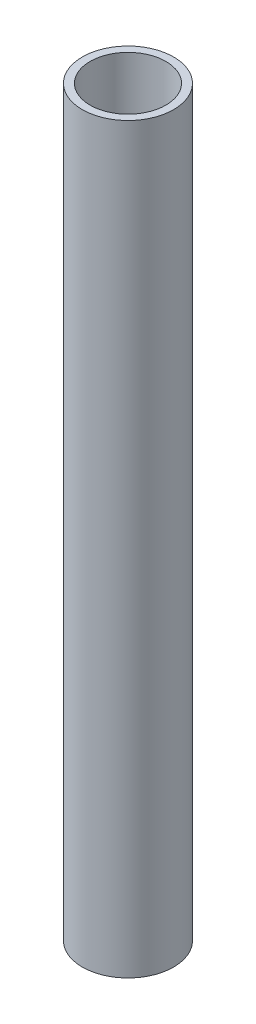
ISO-10303-21;
HEADER;
FILE_DESCRIPTION(('STEP AP214'),'2;1');
FILE_NAME('part.step','',(''),(''),'','','');
FILE_SCHEMA(('AUTOMOTIVE_DESIGN { 1 0 10303 214 1 1 1 1 }'));
ENDSEC;
DATA;
#1=APPLICATION_CONTEXT('core data for automotive mechanical design processes');
#2=APPLICATION_PROTOCOL_DEFINITION('international standard','automotive_design',2000,#1);
#3=PRODUCT_CONTEXT('',#1,'mechanical');
#4=PRODUCT('Part','Part','',(#3));
#5=PRODUCT_RELATED_PRODUCT_CATEGORY('part','',(#4));
#6=PRODUCT_DEFINITION_FORMATION('','',#4);
#7=PRODUCT_DEFINITION_CONTEXT('part definition',#1,'design');
#8=PRODUCT_DEFINITION('design','',#6,#7);
#9=PRODUCT_DEFINITION_SHAPE('','',#8);
#10=(LENGTH_UNIT() NAMED_UNIT(*) SI_UNIT(.MILLI.,.METRE.));
#11=(NAMED_UNIT(*) PLANE_ANGLE_UNIT() SI_UNIT($,.RADIAN.));
#12=(NAMED_UNIT(*) SI_UNIT($,.STERADIAN.) SOLID_ANGLE_UNIT());
#13=UNCERTAINTY_MEASURE_WITH_UNIT(LENGTH_MEASURE(1.E-05),#10,'distance_accuracy_value','');
#14=(GEOMETRIC_REPRESENTATION_CONTEXT(3) GLOBAL_UNCERTAINTY_ASSIGNED_CONTEXT((#13)) GLOBAL_UNIT_ASSIGNED_CONTEXT((#10,
#11,#12)) REPRESENTATION_CONTEXT('',''));
#15=CARTESIAN_POINT('',(0.,0.,0.));
#16=DIRECTION('',(0.,0.,1.));
#17=DIRECTION('',(1.,0.,0.));
#18=AXIS2_PLACEMENT_3D('',#15,#16,#17);
#19=CARTESIAN_POINT('',(0.,342.9,0.));
#20=DIRECTION('',(0.,1.,0.));
#21=DIRECTION('',(0.,0.,1.));
#22=AXIS2_PLACEMENT_3D('',#19,#20,#21);
#23=PLANE('',#22);
#24=CARTESIAN_POINT('',(0.,342.9,0.));
#25=DIRECTION('',(0.,1.,0.));
#26=DIRECTION('',(0.,0.,1.));
#27=AXIS2_PLACEMENT_3D('',#24,#25,#26);
#28=CIRCLE('',#27,21.082);
#29=CARTESIAN_POINT('',(0.,342.9,21.082));
#30=VERTEX_POINT('',#29);
#31=EDGE_CURVE('E10',#30,#30,#28,.T.);
#32=ORIENTED_EDGE('',*,*,#31,.T.);
#33=EDGE_LOOP('',(#32));
#34=FACE_BOUND('',#33,.T.);
#35=CARTESIAN_POINT('',(0.,342.9,0.));
#36=DIRECTION('',(0.,1.,0.));
#37=DIRECTION('',(0.,0.,1.));
#38=AXIS2_PLACEMENT_3D('',#35,#36,#37);
#39=CIRCLE('',#38,17.5006);
#40=CARTESIAN_POINT('',(0.,342.9,17.5006));
#41=VERTEX_POINT('',#40);
#42=EDGE_CURVE('E46',#41,#41,#39,.T.);
#43=ORIENTED_EDGE('',*,*,#42,.F.);
#44=EDGE_LOOP('',(#43));
#45=FACE_BOUND('',#44,.T.);
#46=ADVANCED_FACE('F35',(#34,#45),#23,.T.);
#47=CARTESIAN_POINT('',(0.,0.,0.));
#48=DIRECTION('',(0.,1.,0.));
#49=DIRECTION('',(0.,0.,1.));
#50=AXIS2_PLACEMENT_3D('',#47,#48,#49);
#51=PLANE('',#50);
#52=CARTESIAN_POINT('',(0.,0.,0.));
#53=DIRECTION('',(0.,1.,0.));
#54=DIRECTION('',(0.,0.,1.));
#55=AXIS2_PLACEMENT_3D('',#52,#53,#54);
#56=CIRCLE('',#55,21.082);
#57=CARTESIAN_POINT('',(0.,0.,21.082));
#58=VERTEX_POINT('',#57);
#59=EDGE_CURVE('E39',#58,#58,#56,.T.);
#60=ORIENTED_EDGE('',*,*,#59,.F.);
#61=EDGE_LOOP('',(#60));
#62=FACE_BOUND('',#61,.T.);
#63=CARTESIAN_POINT('',(0.,0.,0.));
#64=DIRECTION('',(0.,1.,0.));
#65=DIRECTION('',(0.,0.,1.));
#66=AXIS2_PLACEMENT_3D('',#63,#64,#65);
#67=CIRCLE('',#66,17.5006);
#68=CARTESIAN_POINT('',(0.,0.,17.5006));
#69=VERTEX_POINT('',#68);
#70=EDGE_CURVE('E48',#69,#69,#67,.T.);
#71=ORIENTED_EDGE('',*,*,#70,.T.);
#72=EDGE_LOOP('',(#71));
#73=FACE_BOUND('',#72,.T.);
#74=ADVANCED_FACE('F58',(#62,#73),#51,.F.);
#75=CARTESIAN_POINT('',(0.,342.9,0.));
#76=DIRECTION('',(0.,-1.,0.));
#77=DIRECTION('',(0.,0.,-1.));
#78=AXIS2_PLACEMENT_3D('',#75,#76,#77);
#79=CYLINDRICAL_SURFACE('',#78,21.082);
#80=ORIENTED_EDGE('',*,*,#31,.F.);
#81=EDGE_LOOP('',(#80));
#82=FACE_BOUND('',#81,.T.);
#83=ORIENTED_EDGE('',*,*,#59,.T.);
#84=EDGE_LOOP('',(#83));
#85=FACE_BOUND('',#84,.T.);
#86=ADVANCED_FACE('F37',(#82,#85),#79,.T.);
#87=CARTESIAN_POINT('',(0.,342.9,0.));
#88=DIRECTION('',(0.,-1.,0.));
#89=DIRECTION('',(0.,0.,-1.));
#90=AXIS2_PLACEMENT_3D('',#87,#88,#89);
#91=CYLINDRICAL_SURFACE('',#90,17.5006);
#92=ORIENTED_EDGE('',*,*,#42,.T.);
#93=EDGE_LOOP('',(#92));
#94=FACE_BOUND('',#93,.T.);
#95=ORIENTED_EDGE('',*,*,#70,.F.);
#96=EDGE_LOOP('',(#95));
#97=FACE_BOUND('',#96,.T.);
#98=ADVANCED_FACE('F54',(#94,#97),#91,.F.);
#99=CLOSED_SHELL('',(#46,#74,#86,#98));
#100=MANIFOLD_SOLID_BREP('B2',#99);
#101=ADVANCED_BREP_SHAPE_REPRESENTATION('',(#18,#100),#14);
#102=SHAPE_DEFINITION_REPRESENTATION(#9,#101);
ENDSEC;
END-ISO-10303-21;
